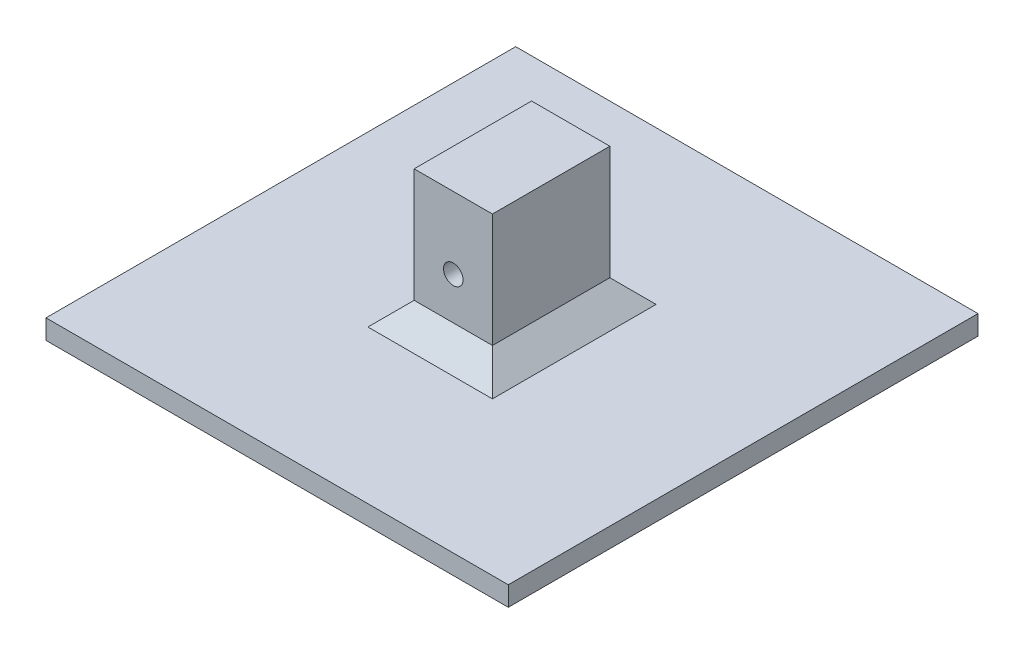
ISO-10303-21;
HEADER;
FILE_DESCRIPTION(('STEP AP214'),'2;1');
FILE_NAME('part.step','',(''),(''),'','','');
FILE_SCHEMA(('AUTOMOTIVE_DESIGN { 1 0 10303 214 1 1 1 1 }'));
ENDSEC;
DATA;
#1=APPLICATION_CONTEXT('core data for automotive mechanical design processes');
#2=APPLICATION_PROTOCOL_DEFINITION('international standard','automotive_design',2000,#1);
#3=PRODUCT_CONTEXT('',#1,'mechanical');
#4=PRODUCT('Part','Part','',(#3));
#5=PRODUCT_RELATED_PRODUCT_CATEGORY('part','',(#4));
#6=PRODUCT_DEFINITION_FORMATION('','',#4);
#7=PRODUCT_DEFINITION_CONTEXT('part definition',#1,'design');
#8=PRODUCT_DEFINITION('design','',#6,#7);
#9=PRODUCT_DEFINITION_SHAPE('','',#8);
#10=(LENGTH_UNIT() NAMED_UNIT(*) SI_UNIT(.MILLI.,.METRE.));
#11=(NAMED_UNIT(*) PLANE_ANGLE_UNIT() SI_UNIT($,.RADIAN.));
#12=(NAMED_UNIT(*) SI_UNIT($,.STERADIAN.) SOLID_ANGLE_UNIT());
#13=UNCERTAINTY_MEASURE_WITH_UNIT(LENGTH_MEASURE(1.E-05),#10,'distance_accuracy_value','');
#14=(GEOMETRIC_REPRESENTATION_CONTEXT(3) GLOBAL_UNCERTAINTY_ASSIGNED_CONTEXT((#13)) GLOBAL_UNIT_ASSIGNED_CONTEXT((#10,
#11,#12)) REPRESENTATION_CONTEXT('',''));
#15=CARTESIAN_POINT('',(0.,0.,0.));
#16=DIRECTION('',(0.,0.,1.));
#17=DIRECTION('',(1.,0.,0.));
#18=AXIS2_PLACEMENT_3D('',#15,#16,#17);
#19=CARTESIAN_POINT('',(-12.7,50.8,19.05));
#20=DIRECTION('',(0.,0.,1.));
#21=DIRECTION('',(0.,-1.,0.));
#22=AXIS2_PLACEMENT_3D('',#19,#20,#21);
#23=PLANE('',#22);
#24=CARTESIAN_POINT('',(0.,27.5181,19.05));
#25=DIRECTION('',(0.,0.,1.));
#26=DIRECTION('',(1.,0.,0.));
#27=AXIS2_PLACEMENT_3D('',#24,#25,#26);
#28=CIRCLE('',#27,3.17499999999999);
#29=CARTESIAN_POINT('',(3.17499999999999,27.5181,19.05));
#30=VERTEX_POINT('',#29);
#31=EDGE_CURVE('E165',#30,#30,#28,.T.);
#32=ORIENTED_EDGE('',*,*,#31,.F.);
#33=EDGE_LOOP('',(#32));
#34=FACE_BOUND('',#33,.T.);
#35=DIRECTION('',(0.,-1.,0.));
#36=VECTOR('',#35,1.);
#37=CARTESIAN_POINT('',(-12.7,50.8,19.05));
#38=LINE('',#37,#36);
#39=CARTESIAN_POINT('',(-12.7,50.8,19.05));
#40=VERTEX_POINT('',#39);
#41=CARTESIAN_POINT('',(-12.7,13.85,19.05));
#42=VERTEX_POINT('',#41);
#43=EDGE_CURVE('E181',#40,#42,#38,.T.);
#44=ORIENTED_EDGE('',*,*,#43,.T.);
#45=DIRECTION('',(1.,0.,0.));
#46=VECTOR('',#45,1.);
#47=CARTESIAN_POINT('',(12.7,13.85,19.05));
#48=LINE('',#47,#46);
#49=CARTESIAN_POINT('',(12.7,13.85,19.05));
#50=VERTEX_POINT('',#49);
#51=EDGE_CURVE('E187',#42,#50,#48,.T.);
#52=ORIENTED_EDGE('',*,*,#51,.T.);
#53=DIRECTION('',(0.,-1.,0.));
#54=VECTOR('',#53,1.);
#55=CARTESIAN_POINT('',(12.7,50.8,19.05));
#56=LINE('',#55,#54);
#57=CARTESIAN_POINT('',(12.7,50.8,19.05));
#58=VERTEX_POINT('',#57);
#59=EDGE_CURVE('E174',#58,#50,#56,.T.);
#60=ORIENTED_EDGE('',*,*,#59,.F.);
#61=DIRECTION('',(1.,0.,0.));
#62=VECTOR('',#61,1.);
#63=CARTESIAN_POINT('',(-12.7,50.8,19.05));
#64=LINE('',#63,#62);
#65=EDGE_CURVE('E185',#40,#58,#64,.T.);
#66=ORIENTED_EDGE('',*,*,#65,.F.);
#67=EDGE_LOOP('',(#44,#52,#60,#66));
#68=FACE_BOUND('',#67,.T.);
#69=ADVANCED_FACE('F47',(#34,#68),#23,.T.);
#70=CARTESIAN_POINT('',(-12.7,50.8,19.05));
#71=DIRECTION('',(0.,1.,0.));
#72=DIRECTION('',(0.,0.,1.));
#73=AXIS2_PLACEMENT_3D('',#70,#71,#72);
#74=PLANE('',#73);
#75=ORIENTED_EDGE('',*,*,#65,.T.);
#76=DIRECTION('',(0.,0.,1.));
#77=VECTOR('',#76,1.);
#78=CARTESIAN_POINT('',(12.7,50.8,19.05));
#79=LINE('',#78,#77);
#80=CARTESIAN_POINT('',(12.7,50.8,-19.05));
#81=VERTEX_POINT('',#80);
#82=EDGE_CURVE('E171',#81,#58,#79,.T.);
#83=ORIENTED_EDGE('',*,*,#82,.F.);
#84=DIRECTION('',(1.,0.,0.));
#85=VECTOR('',#84,1.);
#86=CARTESIAN_POINT('',(-12.7,50.8,-19.05));
#87=LINE('',#86,#85);
#88=CARTESIAN_POINT('',(-12.7,50.8,-19.05));
#89=VERTEX_POINT('',#88);
#90=EDGE_CURVE('E188',#89,#81,#87,.T.);
#91=ORIENTED_EDGE('',*,*,#90,.F.);
#92=DIRECTION('',(0.,0.,1.));
#93=VECTOR('',#92,1.);
#94=CARTESIAN_POINT('',(-12.7,50.8,19.05));
#95=LINE('',#94,#93);
#96=EDGE_CURVE('E178',#89,#40,#95,.T.);
#97=ORIENTED_EDGE('',*,*,#96,.T.);
#98=EDGE_LOOP('',(#75,#83,#91,#97));
#99=FACE_BOUND('',#98,.T.);
#100=ADVANCED_FACE('F237',(#99),#74,.T.);
#101=CARTESIAN_POINT('',(-12.7,50.8,-19.05));
#102=DIRECTION('',(0.,0.,-1.));
#103=DIRECTION('',(0.,1.,0.));
#104=AXIS2_PLACEMENT_3D('',#101,#102,#103);
#105=PLANE('',#104);
#106=CARTESIAN_POINT('',(0.,27.5181,-19.05));
#107=DIRECTION('',(0.,0.,-1.));
#108=DIRECTION('',(0.,1.,0.));
#109=AXIS2_PLACEMENT_3D('',#106,#107,#108);
#110=CIRCLE('',#109,3.17499999999998);
#111=CARTESIAN_POINT('',(0.,30.6931,-19.05));
#112=VERTEX_POINT('',#111);
#113=EDGE_CURVE('E168',#112,#112,#110,.T.);
#114=ORIENTED_EDGE('',*,*,#113,.F.);
#115=EDGE_LOOP('',(#114));
#116=FACE_BOUND('',#115,.T.);
#117=DIRECTION('',(0.,1.,0.));
#118=VECTOR('',#117,1.);
#119=CARTESIAN_POINT('',(12.7,50.8,-19.05));
#120=LINE('',#119,#118);
#121=CARTESIAN_POINT('',(12.7,13.85,-19.05));
#122=VERTEX_POINT('',#121);
#123=EDGE_CURVE('E169',#122,#81,#120,.T.);
#124=ORIENTED_EDGE('',*,*,#123,.F.);
#125=DIRECTION('',(-1.,0.,0.));
#126=VECTOR('',#125,1.);
#127=CARTESIAN_POINT('',(-12.7,13.85,-19.05));
#128=LINE('',#127,#126);
#129=CARTESIAN_POINT('',(-12.7,13.85,-19.05));
#130=VERTEX_POINT('',#129);
#131=EDGE_CURVE('E57',#122,#130,#128,.T.);
#132=ORIENTED_EDGE('',*,*,#131,.T.);
#133=DIRECTION('',(0.,1.,0.));
#134=VECTOR('',#133,1.);
#135=CARTESIAN_POINT('',(-12.7,50.8,-19.05));
#136=LINE('',#135,#134);
#137=EDGE_CURVE('E176',#130,#89,#136,.T.);
#138=ORIENTED_EDGE('',*,*,#137,.T.);
#139=ORIENTED_EDGE('',*,*,#90,.T.);
#140=EDGE_LOOP('',(#124,#132,#138,#139));
#141=FACE_BOUND('',#140,.T.);
#142=ADVANCED_FACE('F238',(#116,#141),#105,.T.);
#143=CARTESIAN_POINT('',(-12.7,6.35,-19.05));
#144=DIRECTION('',(0.,1.,0.));
#145=DIRECTION('',(0.,0.,1.));
#146=AXIS2_PLACEMENT_3D('',#143,#144,#145);
#147=PLANE('',#146);
#148=DIRECTION('',(0.,0.,1.));
#149=VECTOR('',#148,1.);
#150=CARTESIAN_POINT('',(20.1999999999999,6.35,-19.05));
#151=LINE('',#150,#149);
#152=CARTESIAN_POINT('',(20.1999999999999,6.35,-26.5499999999999));
#153=VERTEX_POINT('',#152);
#154=CARTESIAN_POINT('',(20.1999999999999,6.35000000000002,26.55));
#155=VERTEX_POINT('',#154);
#156=EDGE_CURVE('E198',#153,#155,#151,.T.);
#157=ORIENTED_EDGE('',*,*,#156,.T.);
#158=DIRECTION('',(-1.,0.,0.));
#159=VECTOR('',#158,1.);
#160=CARTESIAN_POINT('',(-12.7,6.35000000000002,26.55));
#161=LINE('',#160,#159);
#162=CARTESIAN_POINT('',(-20.1999999999999,6.35000000000002,26.55));
#163=VERTEX_POINT('',#162);
#164=EDGE_CURVE('E204',#155,#163,#161,.T.);
#165=ORIENTED_EDGE('',*,*,#164,.T.);
#166=DIRECTION('',(0.,0.,-1.));
#167=VECTOR('',#166,1.);
#168=CARTESIAN_POINT('',(-20.1999999999999,6.35,-19.05));
#169=LINE('',#168,#167);
#170=CARTESIAN_POINT('',(-20.1999999999999,6.35,-26.5499999999999));
#171=VERTEX_POINT('',#170);
#172=EDGE_CURVE('E202',#163,#171,#169,.T.);
#173=ORIENTED_EDGE('',*,*,#172,.T.);
#174=DIRECTION('',(1.,0.,0.));
#175=VECTOR('',#174,1.);
#176=CARTESIAN_POINT('',(12.7,6.35,-26.5499999999999));
#177=LINE('',#176,#175);
#178=EDGE_CURVE('E200',#171,#153,#177,.T.);
#179=ORIENTED_EDGE('',*,*,#178,.T.);
#180=EDGE_LOOP('',(#157,#165,#173,#179));
#181=FACE_BOUND('',#180,.T.);
#182=DIRECTION('',(0.,0.,1.));
#183=VECTOR('',#182,1.);
#184=CARTESIAN_POINT('',(-75.,6.34999999999998,76.2));
#185=LINE('',#184,#183);
#186=CARTESIAN_POINT('',(-75.,6.34999999999998,-76.2));
#187=VERTEX_POINT('',#186);
#188=CARTESIAN_POINT('',(-75.,6.34999999999998,76.2));
#189=VERTEX_POINT('',#188);
#190=EDGE_CURVE('E159',#187,#189,#185,.T.);
#191=ORIENTED_EDGE('',*,*,#190,.T.);
#192=DIRECTION('',(1.,0.,0.));
#193=VECTOR('',#192,1.);
#194=CARTESIAN_POINT('',(-12.7,6.34999999999998,76.2));
#195=LINE('',#194,#193);
#196=CARTESIAN_POINT('',(75.,6.34999999999998,76.2));
#197=VERTEX_POINT('',#196);
#198=EDGE_CURVE('E184',#189,#197,#195,.T.);
#199=ORIENTED_EDGE('',*,*,#198,.T.);
#200=DIRECTION('',(0.,0.,1.));
#201=VECTOR('',#200,1.);
#202=CARTESIAN_POINT('',(75.,6.34999999999998,76.2));
#203=LINE('',#202,#201);
#204=CARTESIAN_POINT('',(75.,6.34999999999998,-76.2));
#205=VERTEX_POINT('',#204);
#206=EDGE_CURVE('E144',#205,#197,#203,.T.);
#207=ORIENTED_EDGE('',*,*,#206,.F.);
#208=DIRECTION('',(1.,0.,0.));
#209=VECTOR('',#208,1.);
#210=CARTESIAN_POINT('',(-12.7,6.34999999999998,-76.2));
#211=LINE('',#210,#209);
#212=EDGE_CURVE('E135',#187,#205,#211,.T.);
#213=ORIENTED_EDGE('',*,*,#212,.F.);
#214=EDGE_LOOP('',(#191,#199,#207,#213));
#215=FACE_BOUND('',#214,.T.);
#216=ADVANCED_FACE('F264',(#181,#215),#147,.T.);
#217=CARTESIAN_POINT('',(-12.7,6.34999999999998,-76.2));
#218=DIRECTION('',(0.,0.,-1.));
#219=DIRECTION('',(-1.,0.,0.));
#220=AXIS2_PLACEMENT_3D('',#217,#218,#219);
#221=PLANE('',#220);
#222=ORIENTED_EDGE('',*,*,#212,.T.);
#223=DIRECTION('',(0.,1.,0.));
#224=VECTOR('',#223,1.);
#225=CARTESIAN_POINT('',(75.,0.,-76.2));
#226=LINE('',#225,#224);
#227=CARTESIAN_POINT('',(75.,0.,-76.2));
#228=VERTEX_POINT('',#227);
#229=EDGE_CURVE('E139',#228,#205,#226,.T.);
#230=ORIENTED_EDGE('',*,*,#229,.F.);
#231=DIRECTION('',(1.,0.,0.));
#232=VECTOR('',#231,1.);
#233=CARTESIAN_POINT('',(-12.7,0.,-76.2));
#234=LINE('',#233,#232);
#235=CARTESIAN_POINT('',(-75.,0.,-76.2));
#236=VERTEX_POINT('',#235);
#237=EDGE_CURVE('E125',#236,#228,#234,.T.);
#238=ORIENTED_EDGE('',*,*,#237,.F.);
#239=DIRECTION('',(0.,1.,0.));
#240=VECTOR('',#239,1.);
#241=CARTESIAN_POINT('',(-75.,0.,-76.2));
#242=LINE('',#241,#240);
#243=EDGE_CURVE('E157',#236,#187,#242,.T.);
#244=ORIENTED_EDGE('',*,*,#243,.T.);
#245=EDGE_LOOP('',(#222,#230,#238,#244));
#246=FACE_BOUND('',#245,.T.);
#247=ADVANCED_FACE('F140',(#246),#221,.T.);
#248=CARTESIAN_POINT('',(-12.7,0.,76.2));
#249=DIRECTION('',(0.,-1.,0.));
#250=DIRECTION('',(0.,0.,-1.));
#251=AXIS2_PLACEMENT_3D('',#248,#249,#250);
#252=PLANE('',#251);
#253=ORIENTED_EDGE('',*,*,#237,.T.);
#254=DIRECTION('',(0.,0.,-1.));
#255=VECTOR('',#254,1.);
#256=CARTESIAN_POINT('',(75.,0.,76.2));
#257=LINE('',#256,#255);
#258=CARTESIAN_POINT('',(75.,0.,76.2));
#259=VERTEX_POINT('',#258);
#260=EDGE_CURVE('E129',#259,#228,#257,.T.);
#261=ORIENTED_EDGE('',*,*,#260,.F.);
#262=DIRECTION('',(1.,0.,0.));
#263=VECTOR('',#262,1.);
#264=CARTESIAN_POINT('',(-12.7,0.,76.2));
#265=LINE('',#264,#263);
#266=CARTESIAN_POINT('',(-75.,0.,76.2));
#267=VERTEX_POINT('',#266);
#268=EDGE_CURVE('E136',#267,#259,#265,.T.);
#269=ORIENTED_EDGE('',*,*,#268,.F.);
#270=DIRECTION('',(0.,0.,-1.));
#271=VECTOR('',#270,1.);
#272=CARTESIAN_POINT('',(-75.,0.,76.2));
#273=LINE('',#272,#271);
#274=EDGE_CURVE('E131',#267,#236,#273,.T.);
#275=ORIENTED_EDGE('',*,*,#274,.T.);
#276=EDGE_LOOP('',(#253,#261,#269,#275));
#277=FACE_BOUND('',#276,.T.);
#278=ADVANCED_FACE('F127',(#277),#252,.T.);
#279=CARTESIAN_POINT('',(-12.7,6.34999999999998,76.2));
#280=DIRECTION('',(0.,0.,1.));
#281=DIRECTION('',(1.,0.,0.));
#282=AXIS2_PLACEMENT_3D('',#279,#280,#281);
#283=PLANE('',#282);
#284=ORIENTED_EDGE('',*,*,#268,.T.);
#285=DIRECTION('',(0.,-1.,0.));
#286=VECTOR('',#285,1.);
#287=CARTESIAN_POINT('',(75.,6.34999999999998,76.2));
#288=LINE('',#287,#286);
#289=EDGE_CURVE('E149',#197,#259,#288,.T.);
#290=ORIENTED_EDGE('',*,*,#289,.F.);
#291=ORIENTED_EDGE('',*,*,#198,.F.);
#292=DIRECTION('',(0.,-1.,0.));
#293=VECTOR('',#292,1.);
#294=CARTESIAN_POINT('',(-75.,6.34999999999998,76.2));
#295=LINE('',#294,#293);
#296=EDGE_CURVE('E162',#189,#267,#295,.T.);
#297=ORIENTED_EDGE('',*,*,#296,.T.);
#298=EDGE_LOOP('',(#284,#290,#291,#297));
#299=FACE_BOUND('',#298,.T.);
#300=ADVANCED_FACE('F250',(#299),#283,.T.);
#301=CARTESIAN_POINT('',(-12.7,0.,0.));
#302=DIRECTION('',(-1.,0.,0.));
#303=DIRECTION('',(0.,0.,1.));
#304=AXIS2_PLACEMENT_3D('',#301,#302,#303);
#305=PLANE('',#304);
#306=ORIENTED_EDGE('',*,*,#137,.F.);
#307=DIRECTION('',(0.,0.,1.));
#308=VECTOR('',#307,1.);
#309=CARTESIAN_POINT('',(-12.7,13.85,19.05));
#310=LINE('',#309,#308);
#311=EDGE_CURVE('E207',#130,#42,#310,.T.);
#312=ORIENTED_EDGE('',*,*,#311,.T.);
#313=ORIENTED_EDGE('',*,*,#43,.F.);
#314=ORIENTED_EDGE('',*,*,#96,.F.);
#315=EDGE_LOOP('',(#306,#312,#313,#314));
#316=FACE_BOUND('',#315,.T.);
#317=ADVANCED_FACE('F230',(#316),#305,.T.);
#318=CARTESIAN_POINT('',(12.7,0.,0.));
#319=DIRECTION('',(-1.,0.,0.));
#320=DIRECTION('',(0.,0.,1.));
#321=AXIS2_PLACEMENT_3D('',#318,#319,#320);
#322=PLANE('',#321);
#323=ORIENTED_EDGE('',*,*,#59,.T.);
#324=DIRECTION('',(0.,0.,-1.));
#325=VECTOR('',#324,1.);
#326=CARTESIAN_POINT('',(12.7,13.85,0.));
#327=LINE('',#326,#325);
#328=EDGE_CURVE('E11',#50,#122,#327,.T.);
#329=ORIENTED_EDGE('',*,*,#328,.T.);
#330=ORIENTED_EDGE('',*,*,#123,.T.);
#331=ORIENTED_EDGE('',*,*,#82,.T.);
#332=EDGE_LOOP('',(#323,#329,#330,#331));
#333=FACE_BOUND('',#332,.T.);
#334=ADVANCED_FACE('F239',(#333),#322,.F.);
#335=CARTESIAN_POINT('',(0.,27.5181,19.05));
#336=DIRECTION('',(0.,0.,1.));
#337=DIRECTION('',(1.,0.,0.));
#338=AXIS2_PLACEMENT_3D('',#335,#336,#337);
#339=CYLINDRICAL_SURFACE('',#338,3.17499999999998);
#340=ORIENTED_EDGE('',*,*,#113,.T.);
#341=EDGE_LOOP('',(#340));
#342=FACE_BOUND('',#341,.T.);
#343=ORIENTED_EDGE('',*,*,#31,.T.);
#344=EDGE_LOOP('',(#343));
#345=FACE_BOUND('',#344,.T.);
#346=ADVANCED_FACE('F241',(#342,#345),#339,.F.);
#347=CARTESIAN_POINT('',(75.,0.,0.));
#348=DIRECTION('',(1.,0.,0.));
#349=DIRECTION('',(0.,0.,-1.));
#350=AXIS2_PLACEMENT_3D('',#347,#348,#349);
#351=PLANE('',#350);
#352=ORIENTED_EDGE('',*,*,#260,.T.);
#353=ORIENTED_EDGE('',*,*,#229,.T.);
#354=ORIENTED_EDGE('',*,*,#206,.T.);
#355=ORIENTED_EDGE('',*,*,#289,.T.);
#356=EDGE_LOOP('',(#352,#353,#354,#355));
#357=FACE_BOUND('',#356,.T.);
#358=ADVANCED_FACE('F147',(#357),#351,.T.);
#359=CARTESIAN_POINT('',(-75.,0.,0.));
#360=DIRECTION('',(1.,0.,0.));
#361=DIRECTION('',(0.,0.,-1.));
#362=AXIS2_PLACEMENT_3D('',#359,#360,#361);
#363=PLANE('',#362);
#364=ORIENTED_EDGE('',*,*,#274,.F.);
#365=ORIENTED_EDGE('',*,*,#296,.F.);
#366=ORIENTED_EDGE('',*,*,#190,.F.);
#367=ORIENTED_EDGE('',*,*,#243,.F.);
#368=EDGE_LOOP('',(#364,#365,#366,#367));
#369=FACE_BOUND('',#368,.T.);
#370=ADVANCED_FACE('F293',(#369),#363,.F.);
#371=CARTESIAN_POINT('',(-12.7,6.35,-26.5499999999999));
#372=DIRECTION('',(0.,0.707106781186545,-0.70710678118655));
#373=DIRECTION('',(-1.,0.,0.));
#374=AXIS2_PLACEMENT_3D('',#371,#372,#373);
#375=PLANE('',#374);
#376=DIRECTION('',(0.577350269189624,-0.577350269189629,-0.577350269189624));
#377=VECTOR('',#376,1.);
#378=CARTESIAN_POINT('',(6.35000000000003,20.2,-12.7));
#379=LINE('',#378,#377);
#380=EDGE_CURVE('E152',#153,#122,#379,.F.);
#381=ORIENTED_EDGE('',*,*,#380,.F.);
#382=ORIENTED_EDGE('',*,*,#178,.F.);
#383=DIRECTION('',(0.577350269189624,0.577350269189629,0.577350269189624));
#384=VECTOR('',#383,1.);
#385=CARTESIAN_POINT('',(-17.7,8.84999999999999,-24.05));
#386=LINE('',#385,#384);
#387=EDGE_CURVE('E52',#130,#171,#386,.F.);
#388=ORIENTED_EDGE('',*,*,#387,.F.);
#389=ORIENTED_EDGE('',*,*,#131,.F.);
#390=EDGE_LOOP('',(#381,#382,#388,#389));
#391=FACE_BOUND('',#390,.T.);
#392=ADVANCED_FACE('F50',(#391),#375,.T.);
#393=CARTESIAN_POINT('',(-20.1999999999999,6.35,-19.05));
#394=DIRECTION('',(-0.70710678118655,0.707106781186545,0.));
#395=DIRECTION('',(0.,0.,1.));
#396=AXIS2_PLACEMENT_3D('',#393,#394,#395);
#397=PLANE('',#396);
#398=ORIENTED_EDGE('',*,*,#387,.T.);
#399=ORIENTED_EDGE('',*,*,#172,.F.);
#400=DIRECTION('',(0.577350269189624,0.577350269189628,-0.577350269189624));
#401=VECTOR('',#400,1.);
#402=CARTESIAN_POINT('',(-5.00000000000004,21.55,11.3500000000001));
#403=LINE('',#402,#401);
#404=EDGE_CURVE('E212',#42,#163,#403,.F.);
#405=ORIENTED_EDGE('',*,*,#404,.F.);
#406=ORIENTED_EDGE('',*,*,#311,.F.);
#407=EDGE_LOOP('',(#398,#399,#405,#406));
#408=FACE_BOUND('',#407,.T.);
#409=ADVANCED_FACE('F226',(#408),#397,.T.);
#410=CARTESIAN_POINT('',(12.7,13.85,0.));
#411=DIRECTION('',(-0.70710678118655,-0.707106781186545,0.));
#412=DIRECTION('',(0.,0.,-1.));
#413=AXIS2_PLACEMENT_3D('',#410,#411,#412);
#414=PLANE('',#413);
#415=ORIENTED_EDGE('',*,*,#380,.T.);
#416=ORIENTED_EDGE('',*,*,#328,.F.);
#417=DIRECTION('',(-0.577350269189624,0.577350269189628,-0.577350269189624));
#418=VECTOR('',#417,1.);
#419=CARTESIAN_POINT('',(6.35000000000003,20.2,12.7));
#420=LINE('',#419,#418);
#421=EDGE_CURVE('E210',#155,#50,#420,.T.);
#422=ORIENTED_EDGE('',*,*,#421,.F.);
#423=ORIENTED_EDGE('',*,*,#156,.F.);
#424=EDGE_LOOP('',(#415,#416,#422,#423));
#425=FACE_BOUND('',#424,.T.);
#426=ADVANCED_FACE('F217',(#425),#414,.F.);
#427=CARTESIAN_POINT('',(-12.7,13.85,19.05));
#428=DIRECTION('',(0.,0.707106781186545,0.70710678118655));
#429=DIRECTION('',(-1.,0.,0.));
#430=AXIS2_PLACEMENT_3D('',#427,#428,#429);
#431=PLANE('',#430);
#432=ORIENTED_EDGE('',*,*,#404,.T.);
#433=ORIENTED_EDGE('',*,*,#164,.F.);
#434=ORIENTED_EDGE('',*,*,#421,.T.);
#435=ORIENTED_EDGE('',*,*,#51,.F.);
#436=EDGE_LOOP('',(#432,#433,#434,#435));
#437=FACE_BOUND('',#436,.T.);
#438=ADVANCED_FACE('F277',(#437),#431,.T.);
#439=CLOSED_SHELL('',(#69,#100,#142,#216,#247,#278,#300,#317,#334,#346,#358,#370,#392,#409,#426,#438));
#440=MANIFOLD_SOLID_BREP('B2',#439);
#441=ADVANCED_BREP_SHAPE_REPRESENTATION('',(#18,#440),#14);
#442=SHAPE_DEFINITION_REPRESENTATION(#9,#441);
ENDSEC;
END-ISO-10303-21;
